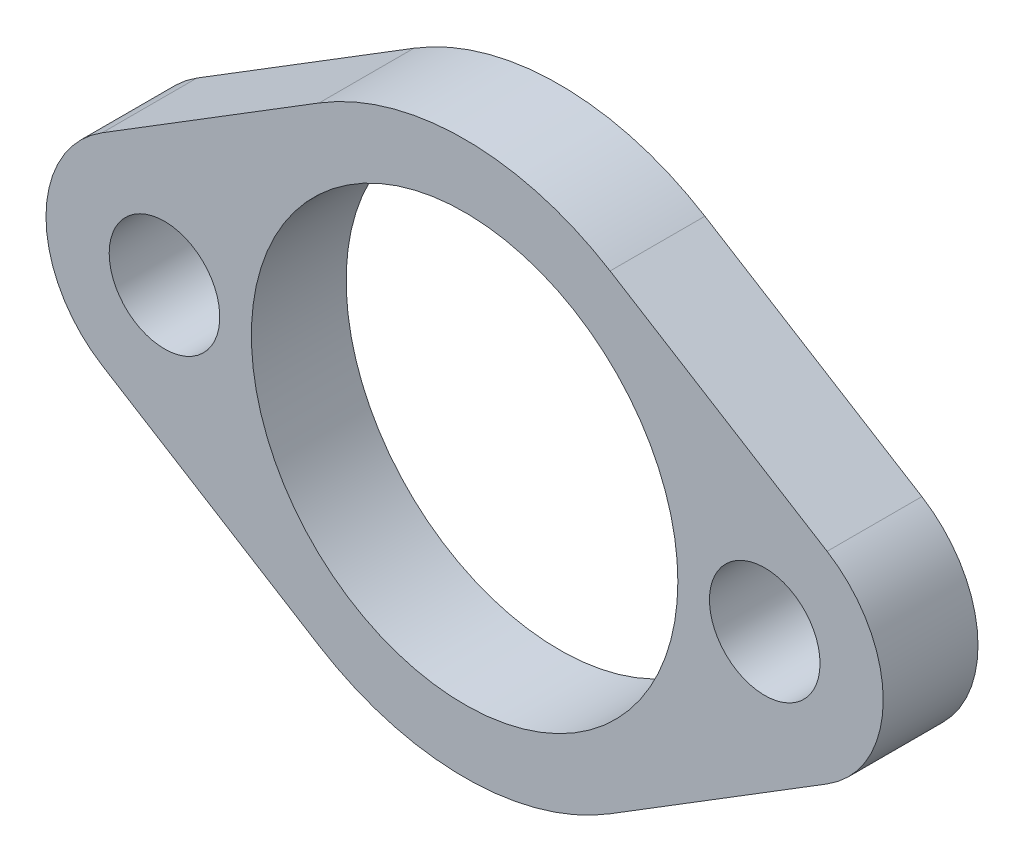
ISO-10303-21;
HEADER;
FILE_DESCRIPTION(('STEP AP214'),'2;1');
FILE_NAME('part.step','',(''),(''),'','','');
FILE_SCHEMA(('AUTOMOTIVE_DESIGN { 1 0 10303 214 1 1 1 1 }'));
ENDSEC;
DATA;
#1=APPLICATION_CONTEXT('core data for automotive mechanical design processes');
#2=APPLICATION_PROTOCOL_DEFINITION('international standard','automotive_design',2000,#1);
#3=PRODUCT_CONTEXT('',#1,'mechanical');
#4=PRODUCT('Part','Part','',(#3));
#5=PRODUCT_RELATED_PRODUCT_CATEGORY('part','',(#4));
#6=PRODUCT_DEFINITION_FORMATION('','',#4);
#7=PRODUCT_DEFINITION_CONTEXT('part definition',#1,'design');
#8=PRODUCT_DEFINITION('design','',#6,#7);
#9=PRODUCT_DEFINITION_SHAPE('','',#8);
#10=(LENGTH_UNIT() NAMED_UNIT(*) SI_UNIT(.MILLI.,.METRE.));
#11=(NAMED_UNIT(*) PLANE_ANGLE_UNIT() SI_UNIT($,.RADIAN.));
#12=(NAMED_UNIT(*) SI_UNIT($,.STERADIAN.) SOLID_ANGLE_UNIT());
#13=UNCERTAINTY_MEASURE_WITH_UNIT(LENGTH_MEASURE(1.E-05),#10,'distance_accuracy_value','');
#14=(GEOMETRIC_REPRESENTATION_CONTEXT(3) GLOBAL_UNCERTAINTY_ASSIGNED_CONTEXT((#13)) GLOBAL_UNIT_ASSIGNED_CONTEXT((#10,
#11,#12)) REPRESENTATION_CONTEXT('',''));
#15=CARTESIAN_POINT('',(0.,0.,0.));
#16=DIRECTION('',(0.,0.,1.));
#17=DIRECTION('',(1.,0.,0.));
#18=AXIS2_PLACEMENT_3D('',#15,#16,#17);
#19=CARTESIAN_POINT('',(0.,0.,3.));
#20=DIRECTION('',(0.,0.,1.));
#21=DIRECTION('',(1.,0.,0.));
#22=AXIS2_PLACEMENT_3D('',#19,#20,#21);
#23=PLANE('',#22);
#24=CARTESIAN_POINT('',(9.5,0.,3.));
#25=DIRECTION('',(0.,0.,1.));
#26=DIRECTION('',(1.,0.,0.));
#27=AXIS2_PLACEMENT_3D('',#24,#25,#26);
#28=CIRCLE('',#27,1.75);
#29=CARTESIAN_POINT('',(11.25,0.,3.));
#30=VERTEX_POINT('',#29);
#31=EDGE_CURVE('E217',#30,#30,#28,.T.);
#32=ORIENTED_EDGE('',*,*,#31,.F.);
#33=EDGE_LOOP('',(#32));
#34=FACE_BOUND('',#33,.T.);
#35=CARTESIAN_POINT('',(0.,0.,3.));
#36=DIRECTION('',(0.,0.,1.));
#37=DIRECTION('',(1.,0.,0.));
#38=AXIS2_PLACEMENT_3D('',#35,#36,#37);
#39=CIRCLE('',#38,8.75);
#40=CARTESIAN_POINT('',(4.60526315789474,7.44003032564635,3.));
#41=VERTEX_POINT('',#40);
#42=CARTESIAN_POINT('',(-4.60526315789473,7.44003032564635,3.));
#43=VERTEX_POINT('',#42);
#44=EDGE_CURVE('E168',#41,#43,#39,.T.);
#45=ORIENTED_EDGE('',*,*,#44,.T.);
#46=DIRECTION('',(-0.850289180073869,-0.526315789473684,0.));
#47=VECTOR('',#46,1.);
#48=CARTESIAN_POINT('',(-4.60526315789473,7.44003032564635,3.));
#49=LINE('',#48,#47);
#50=CARTESIAN_POINT('',(-11.4736842105263,3.18858442527702,3.));
#51=VERTEX_POINT('',#50);
#52=EDGE_CURVE('E104',#43,#51,#49,.T.);
#53=ORIENTED_EDGE('',*,*,#52,.T.);
#54=CARTESIAN_POINT('',(-9.5,0.,3.));
#55=DIRECTION('',(0.,0.,1.));
#56=DIRECTION('',(1.,0.,0.));
#57=AXIS2_PLACEMENT_3D('',#54,#55,#56);
#58=CIRCLE('',#57,3.75);
#59=CARTESIAN_POINT('',(-11.4736842105263,-3.18858442527701,3.));
#60=VERTEX_POINT('',#59);
#61=EDGE_CURVE('E189',#51,#60,#58,.T.);
#62=ORIENTED_EDGE('',*,*,#61,.T.);
#63=DIRECTION('',(0.850289180073869,-0.526315789473684,0.));
#64=VECTOR('',#63,1.);
#65=CARTESIAN_POINT('',(-4.60526315789473,-7.44003032564635,3.));
#66=LINE('',#65,#64);
#67=CARTESIAN_POINT('',(-4.60526315789473,-7.44003032564635,3.));
#68=VERTEX_POINT('',#67);
#69=EDGE_CURVE('E203',#60,#68,#66,.T.);
#70=ORIENTED_EDGE('',*,*,#69,.T.);
#71=CARTESIAN_POINT('',(0.,0.,3.));
#72=DIRECTION('',(0.,0.,1.));
#73=DIRECTION('',(-1.,0.,0.));
#74=AXIS2_PLACEMENT_3D('',#71,#72,#73);
#75=CIRCLE('',#74,8.75);
#76=CARTESIAN_POINT('',(4.60526315789474,-7.44003032564635,3.));
#77=VERTEX_POINT('',#76);
#78=EDGE_CURVE('E123',#68,#77,#75,.T.);
#79=ORIENTED_EDGE('',*,*,#78,.T.);
#80=DIRECTION('',(0.850289180073869,0.526315789473684,0.));
#81=VECTOR('',#80,1.);
#82=CARTESIAN_POINT('',(4.60526315789474,-7.44003032564635,3.));
#83=LINE('',#82,#81);
#84=CARTESIAN_POINT('',(11.4736842105263,-3.18858442527701,3.));
#85=VERTEX_POINT('',#84);
#86=EDGE_CURVE('E117',#77,#85,#83,.T.);
#87=ORIENTED_EDGE('',*,*,#86,.T.);
#88=CARTESIAN_POINT('',(9.5,0.,3.));
#89=DIRECTION('',(0.,0.,1.));
#90=DIRECTION('',(-1.,0.,0.));
#91=AXIS2_PLACEMENT_3D('',#88,#89,#90);
#92=CIRCLE('',#91,3.75);
#93=CARTESIAN_POINT('',(11.4736842105263,3.18858442527701,3.));
#94=VERTEX_POINT('',#93);
#95=EDGE_CURVE('E121',#85,#94,#92,.T.);
#96=ORIENTED_EDGE('',*,*,#95,.T.);
#97=DIRECTION('',(-0.850289180073869,0.526315789473684,0.));
#98=VECTOR('',#97,1.);
#99=CARTESIAN_POINT('',(4.60526315789474,7.44003032564635,3.));
#100=LINE('',#99,#98);
#101=EDGE_CURVE('E61',#94,#41,#100,.T.);
#102=ORIENTED_EDGE('',*,*,#101,.T.);
#103=EDGE_LOOP('',(#45,#53,#62,#70,#79,#87,#96,#102));
#104=FACE_BOUND('',#103,.T.);
#105=CARTESIAN_POINT('',(0.,0.,3.));
#106=DIRECTION('',(0.,0.,1.));
#107=DIRECTION('',(1.,0.,0.));
#108=AXIS2_PLACEMENT_3D('',#105,#106,#107);
#109=CIRCLE('',#108,6.75);
#110=CARTESIAN_POINT('',(6.75,0.,3.));
#111=VERTEX_POINT('',#110);
#112=EDGE_CURVE('E150',#111,#111,#109,.T.);
#113=ORIENTED_EDGE('',*,*,#112,.F.);
#114=EDGE_LOOP('',(#113));
#115=FACE_BOUND('',#114,.T.);
#116=CARTESIAN_POINT('',(-9.5,0.,3.));
#117=DIRECTION('',(0.,0.,1.));
#118=DIRECTION('',(-1.,0.,0.));
#119=AXIS2_PLACEMENT_3D('',#116,#117,#118);
#120=CIRCLE('',#119,1.75);
#121=CARTESIAN_POINT('',(-11.25,0.,3.));
#122=VERTEX_POINT('',#121);
#123=EDGE_CURVE('E225',#122,#122,#120,.T.);
#124=ORIENTED_EDGE('',*,*,#123,.F.);
#125=EDGE_LOOP('',(#124));
#126=FACE_BOUND('',#125,.T.);
#127=ADVANCED_FACE('F43',(#34,#104,#115,#126),#23,.T.);
#128=CARTESIAN_POINT('',(0.,0.,0.));
#129=DIRECTION('',(0.,0.,1.));
#130=DIRECTION('',(1.,0.,0.));
#131=AXIS2_PLACEMENT_3D('',#128,#129,#130);
#132=PLANE('',#131);
#133=CARTESIAN_POINT('',(0.,0.,0.));
#134=DIRECTION('',(0.,0.,1.));
#135=DIRECTION('',(1.,0.,0.));
#136=AXIS2_PLACEMENT_3D('',#133,#134,#135);
#137=CIRCLE('',#136,8.75);
#138=CARTESIAN_POINT('',(4.60526315789474,7.44003032564635,0.));
#139=VERTEX_POINT('',#138);
#140=CARTESIAN_POINT('',(-4.60526315789473,7.44003032564635,0.));
#141=VERTEX_POINT('',#140);
#142=EDGE_CURVE('E145',#139,#141,#137,.T.);
#143=ORIENTED_EDGE('',*,*,#142,.F.);
#144=DIRECTION('',(-0.850289180073869,0.526315789473684,0.));
#145=VECTOR('',#144,1.);
#146=CARTESIAN_POINT('',(4.60526315789474,7.44003032564635,0.));
#147=LINE('',#146,#145);
#148=CARTESIAN_POINT('',(11.4736842105263,3.18858442527701,0.));
#149=VERTEX_POINT('',#148);
#150=EDGE_CURVE('E96',#149,#139,#147,.T.);
#151=ORIENTED_EDGE('',*,*,#150,.F.);
#152=CARTESIAN_POINT('',(9.5,0.,0.));
#153=DIRECTION('',(0.,0.,1.));
#154=DIRECTION('',(-1.,0.,0.));
#155=AXIS2_PLACEMENT_3D('',#152,#153,#154);
#156=CIRCLE('',#155,3.75);
#157=CARTESIAN_POINT('',(11.4736842105263,-3.18858442527701,0.));
#158=VERTEX_POINT('',#157);
#159=EDGE_CURVE('E90',#158,#149,#156,.T.);
#160=ORIENTED_EDGE('',*,*,#159,.F.);
#161=DIRECTION('',(0.850289180073869,0.526315789473684,0.));
#162=VECTOR('',#161,1.);
#163=CARTESIAN_POINT('',(4.60526315789474,-7.44003032564635,0.));
#164=LINE('',#163,#162);
#165=CARTESIAN_POINT('',(4.60526315789474,-7.44003032564635,0.));
#166=VERTEX_POINT('',#165);
#167=EDGE_CURVE('E132',#166,#158,#164,.T.);
#168=ORIENTED_EDGE('',*,*,#167,.F.);
#169=CARTESIAN_POINT('',(0.,0.,0.));
#170=DIRECTION('',(0.,0.,1.));
#171=DIRECTION('',(-1.,0.,0.));
#172=AXIS2_PLACEMENT_3D('',#169,#170,#171);
#173=CIRCLE('',#172,8.75);
#174=CARTESIAN_POINT('',(-4.60526315789473,-7.44003032564635,0.));
#175=VERTEX_POINT('',#174);
#176=EDGE_CURVE('E159',#175,#166,#173,.T.);
#177=ORIENTED_EDGE('',*,*,#176,.F.);
#178=DIRECTION('',(0.850289180073869,-0.526315789473684,0.));
#179=VECTOR('',#178,1.);
#180=CARTESIAN_POINT('',(-4.60526315789473,-7.44003032564635,0.));
#181=LINE('',#180,#179);
#182=CARTESIAN_POINT('',(-11.4736842105263,-3.18858442527701,0.));
#183=VERTEX_POINT('',#182);
#184=EDGE_CURVE('E156',#183,#175,#181,.T.);
#185=ORIENTED_EDGE('',*,*,#184,.F.);
#186=CARTESIAN_POINT('',(-9.5,0.,0.));
#187=DIRECTION('',(0.,0.,1.));
#188=DIRECTION('',(1.,0.,0.));
#189=AXIS2_PLACEMENT_3D('',#186,#187,#188);
#190=CIRCLE('',#189,3.75);
#191=CARTESIAN_POINT('',(-11.4736842105263,3.18858442527702,0.));
#192=VERTEX_POINT('',#191);
#193=EDGE_CURVE('E153',#192,#183,#190,.T.);
#194=ORIENTED_EDGE('',*,*,#193,.F.);
#195=DIRECTION('',(-0.850289180073869,-0.526315789473684,0.));
#196=VECTOR('',#195,1.);
#197=CARTESIAN_POINT('',(-4.60526315789473,7.44003032564635,0.));
#198=LINE('',#197,#196);
#199=EDGE_CURVE('E149',#141,#192,#198,.T.);
#200=ORIENTED_EDGE('',*,*,#199,.F.);
#201=EDGE_LOOP('',(#143,#151,#160,#168,#177,#185,#194,#200));
#202=FACE_BOUND('',#201,.T.);
#203=CARTESIAN_POINT('',(0.,0.,0.));
#204=DIRECTION('',(0.,0.,1.));
#205=DIRECTION('',(1.,0.,0.));
#206=AXIS2_PLACEMENT_3D('',#203,#204,#205);
#207=CIRCLE('',#206,6.75);
#208=CARTESIAN_POINT('',(6.75,0.,0.));
#209=VERTEX_POINT('',#208);
#210=EDGE_CURVE('E213',#209,#209,#207,.T.);
#211=ORIENTED_EDGE('',*,*,#210,.T.);
#212=EDGE_LOOP('',(#211));
#213=FACE_BOUND('',#212,.T.);
#214=CARTESIAN_POINT('',(9.5,0.,0.));
#215=DIRECTION('',(0.,0.,1.));
#216=DIRECTION('',(1.,0.,0.));
#217=AXIS2_PLACEMENT_3D('',#214,#215,#216);
#218=CIRCLE('',#217,1.75);
#219=CARTESIAN_POINT('',(11.25,0.,0.));
#220=VERTEX_POINT('',#219);
#221=EDGE_CURVE('E221',#220,#220,#218,.T.);
#222=ORIENTED_EDGE('',*,*,#221,.T.);
#223=EDGE_LOOP('',(#222));
#224=FACE_BOUND('',#223,.T.);
#225=CARTESIAN_POINT('',(-9.5,0.,0.));
#226=DIRECTION('',(0.,0.,1.));
#227=DIRECTION('',(-1.,0.,0.));
#228=AXIS2_PLACEMENT_3D('',#225,#226,#227);
#229=CIRCLE('',#228,1.75);
#230=CARTESIAN_POINT('',(-11.25,0.,0.));
#231=VERTEX_POINT('',#230);
#232=EDGE_CURVE('E229',#231,#231,#229,.T.);
#233=ORIENTED_EDGE('',*,*,#232,.T.);
#234=EDGE_LOOP('',(#233));
#235=FACE_BOUND('',#234,.T.);
#236=ADVANCED_FACE('F193',(#202,#213,#224,#235),#132,.F.);
#237=CARTESIAN_POINT('',(0.,0.,3.));
#238=DIRECTION('',(0.,0.,-1.));
#239=DIRECTION('',(-1.,0.,0.));
#240=AXIS2_PLACEMENT_3D('',#237,#238,#239);
#241=CYLINDRICAL_SURFACE('',#240,8.75);
#242=ORIENTED_EDGE('',*,*,#142,.T.);
#243=DIRECTION('',(0.,0.,-1.));
#244=VECTOR('',#243,1.);
#245=CARTESIAN_POINT('',(-4.60526315789473,7.44003032564635,3.));
#246=LINE('',#245,#244);
#247=EDGE_CURVE('E11',#43,#141,#246,.T.);
#248=ORIENTED_EDGE('',*,*,#247,.F.);
#249=ORIENTED_EDGE('',*,*,#44,.F.);
#250=DIRECTION('',(0.,0.,-1.));
#251=VECTOR('',#250,1.);
#252=CARTESIAN_POINT('',(4.60526315789474,7.44003032564635,3.));
#253=LINE('',#252,#251);
#254=EDGE_CURVE('E141',#41,#139,#253,.T.);
#255=ORIENTED_EDGE('',*,*,#254,.T.);
#256=EDGE_LOOP('',(#242,#248,#249,#255));
#257=FACE_BOUND('',#256,.T.);
#258=ADVANCED_FACE('F45',(#257),#241,.T.);
#259=CARTESIAN_POINT('',(-4.60526315789473,7.44003032564635,3.));
#260=DIRECTION('',(0.526315789473684,-0.850289180073869,0.));
#261=DIRECTION('',(0.850289180073869,0.526315789473684,0.));
#262=AXIS2_PLACEMENT_3D('',#259,#260,#261);
#263=PLANE('',#262);
#264=ORIENTED_EDGE('',*,*,#199,.T.);
#265=DIRECTION('',(0.,0.,-1.));
#266=VECTOR('',#265,1.);
#267=CARTESIAN_POINT('',(-11.4736842105263,3.18858442527702,3.));
#268=LINE('',#267,#266);
#269=EDGE_CURVE('E53',#51,#192,#268,.T.);
#270=ORIENTED_EDGE('',*,*,#269,.F.);
#271=ORIENTED_EDGE('',*,*,#52,.F.);
#272=ORIENTED_EDGE('',*,*,#247,.T.);
#273=EDGE_LOOP('',(#264,#270,#271,#272));
#274=FACE_BOUND('',#273,.T.);
#275=ADVANCED_FACE('F264',(#274),#263,.F.);
#276=CARTESIAN_POINT('',(-9.5,0.,3.));
#277=DIRECTION('',(0.,0.,-1.));
#278=DIRECTION('',(-1.,0.,0.));
#279=AXIS2_PLACEMENT_3D('',#276,#277,#278);
#280=CYLINDRICAL_SURFACE('',#279,3.75);
#281=ORIENTED_EDGE('',*,*,#193,.T.);
#282=DIRECTION('',(0.,0.,-1.));
#283=VECTOR('',#282,1.);
#284=CARTESIAN_POINT('',(-11.4736842105263,-3.18858442527701,3.));
#285=LINE('',#284,#283);
#286=EDGE_CURVE('E179',#60,#183,#285,.T.);
#287=ORIENTED_EDGE('',*,*,#286,.F.);
#288=ORIENTED_EDGE('',*,*,#61,.F.);
#289=ORIENTED_EDGE('',*,*,#269,.T.);
#290=EDGE_LOOP('',(#281,#287,#288,#289));
#291=FACE_BOUND('',#290,.T.);
#292=ADVANCED_FACE('F187',(#291),#280,.T.);
#293=CARTESIAN_POINT('',(-4.60526315789473,-7.44003032564635,3.));
#294=DIRECTION('',(0.526315789473684,0.850289180073869,0.));
#295=DIRECTION('',(-0.850289180073869,0.526315789473684,0.));
#296=AXIS2_PLACEMENT_3D('',#293,#294,#295);
#297=PLANE('',#296);
#298=ORIENTED_EDGE('',*,*,#184,.T.);
#299=DIRECTION('',(0.,0.,-1.));
#300=VECTOR('',#299,1.);
#301=CARTESIAN_POINT('',(-4.60526315789473,-7.44003032564635,3.));
#302=LINE('',#301,#300);
#303=EDGE_CURVE('E175',#68,#175,#302,.T.);
#304=ORIENTED_EDGE('',*,*,#303,.F.);
#305=ORIENTED_EDGE('',*,*,#69,.F.);
#306=ORIENTED_EDGE('',*,*,#286,.T.);
#307=EDGE_LOOP('',(#298,#304,#305,#306));
#308=FACE_BOUND('',#307,.T.);
#309=ADVANCED_FACE('F198',(#308),#297,.F.);
#310=CARTESIAN_POINT('',(0.,0.,3.));
#311=DIRECTION('',(0.,0.,-1.));
#312=DIRECTION('',(-1.,0.,0.));
#313=AXIS2_PLACEMENT_3D('',#310,#311,#312);
#314=CYLINDRICAL_SURFACE('',#313,8.75);
#315=ORIENTED_EDGE('',*,*,#176,.T.);
#316=DIRECTION('',(0.,0.,-1.));
#317=VECTOR('',#316,1.);
#318=CARTESIAN_POINT('',(4.60526315789474,-7.44003032564635,3.));
#319=LINE('',#318,#317);
#320=EDGE_CURVE('E134',#77,#166,#319,.T.);
#321=ORIENTED_EDGE('',*,*,#320,.F.);
#322=ORIENTED_EDGE('',*,*,#78,.F.);
#323=ORIENTED_EDGE('',*,*,#303,.T.);
#324=EDGE_LOOP('',(#315,#321,#322,#323));
#325=FACE_BOUND('',#324,.T.);
#326=ADVANCED_FACE('F201',(#325),#314,.T.);
#327=CARTESIAN_POINT('',(4.60526315789474,-7.44003032564635,3.));
#328=DIRECTION('',(-0.526315789473684,0.850289180073869,0.));
#329=DIRECTION('',(-0.850289180073869,-0.526315789473684,0.));
#330=AXIS2_PLACEMENT_3D('',#327,#328,#329);
#331=PLANE('',#330);
#332=ORIENTED_EDGE('',*,*,#167,.T.);
#333=DIRECTION('',(0.,0.,-1.));
#334=VECTOR('',#333,1.);
#335=CARTESIAN_POINT('',(11.4736842105263,-3.18858442527701,3.));
#336=LINE('',#335,#334);
#337=EDGE_CURVE('E129',#85,#158,#336,.T.);
#338=ORIENTED_EDGE('',*,*,#337,.F.);
#339=ORIENTED_EDGE('',*,*,#86,.F.);
#340=ORIENTED_EDGE('',*,*,#320,.T.);
#341=EDGE_LOOP('',(#332,#338,#339,#340));
#342=FACE_BOUND('',#341,.T.);
#343=ADVANCED_FACE('F130',(#342),#331,.F.);
#344=CARTESIAN_POINT('',(9.5,0.,3.));
#345=DIRECTION('',(0.,0.,-1.));
#346=DIRECTION('',(-1.,0.,0.));
#347=AXIS2_PLACEMENT_3D('',#344,#345,#346);
#348=CYLINDRICAL_SURFACE('',#347,3.75);
#349=ORIENTED_EDGE('',*,*,#159,.T.);
#350=DIRECTION('',(0.,0.,-1.));
#351=VECTOR('',#350,1.);
#352=CARTESIAN_POINT('',(11.4736842105263,3.18858442527701,3.));
#353=LINE('',#352,#351);
#354=EDGE_CURVE('E135',#94,#149,#353,.T.);
#355=ORIENTED_EDGE('',*,*,#354,.F.);
#356=ORIENTED_EDGE('',*,*,#95,.F.);
#357=ORIENTED_EDGE('',*,*,#337,.T.);
#358=EDGE_LOOP('',(#349,#355,#356,#357));
#359=FACE_BOUND('',#358,.T.);
#360=ADVANCED_FACE('F137',(#359),#348,.T.);
#361=CARTESIAN_POINT('',(4.60526315789474,7.44003032564635,3.));
#362=DIRECTION('',(-0.526315789473684,-0.850289180073869,0.));
#363=DIRECTION('',(0.850289180073869,-0.526315789473684,0.));
#364=AXIS2_PLACEMENT_3D('',#361,#362,#363);
#365=PLANE('',#364);
#366=ORIENTED_EDGE('',*,*,#150,.T.);
#367=ORIENTED_EDGE('',*,*,#254,.F.);
#368=ORIENTED_EDGE('',*,*,#101,.F.);
#369=ORIENTED_EDGE('',*,*,#354,.T.);
#370=EDGE_LOOP('',(#366,#367,#368,#369));
#371=FACE_BOUND('',#370,.T.);
#372=ADVANCED_FACE('F252',(#371),#365,.F.);
#373=CARTESIAN_POINT('',(0.,0.,3.));
#374=DIRECTION('',(0.,0.,-1.));
#375=DIRECTION('',(-1.,0.,0.));
#376=AXIS2_PLACEMENT_3D('',#373,#374,#375);
#377=CYLINDRICAL_SURFACE('',#376,6.75);
#378=ORIENTED_EDGE('',*,*,#112,.T.);
#379=EDGE_LOOP('',(#378));
#380=FACE_BOUND('',#379,.T.);
#381=ORIENTED_EDGE('',*,*,#210,.F.);
#382=EDGE_LOOP('',(#381));
#383=FACE_BOUND('',#382,.T.);
#384=ADVANCED_FACE('F249',(#380,#383),#377,.F.);
#385=CARTESIAN_POINT('',(9.5,0.,3.));
#386=DIRECTION('',(0.,0.,-1.));
#387=DIRECTION('',(-1.,0.,0.));
#388=AXIS2_PLACEMENT_3D('',#385,#386,#387);
#389=CYLINDRICAL_SURFACE('',#388,1.75);
#390=ORIENTED_EDGE('',*,*,#31,.T.);
#391=EDGE_LOOP('',(#390));
#392=FACE_BOUND('',#391,.T.);
#393=ORIENTED_EDGE('',*,*,#221,.F.);
#394=EDGE_LOOP('',(#393));
#395=FACE_BOUND('',#394,.T.);
#396=ADVANCED_FACE('F340',(#392,#395),#389,.F.);
#397=CARTESIAN_POINT('',(-9.5,0.,3.));
#398=DIRECTION('',(0.,0.,-1.));
#399=DIRECTION('',(-1.,0.,0.));
#400=AXIS2_PLACEMENT_3D('',#397,#398,#399);
#401=CYLINDRICAL_SURFACE('',#400,1.75);
#402=ORIENTED_EDGE('',*,*,#123,.T.);
#403=EDGE_LOOP('',(#402));
#404=FACE_BOUND('',#403,.T.);
#405=ORIENTED_EDGE('',*,*,#232,.F.);
#406=EDGE_LOOP('',(#405));
#407=FACE_BOUND('',#406,.T.);
#408=ADVANCED_FACE('F237',(#404,#407),#401,.F.);
#409=CLOSED_SHELL('',(#127,#236,#258,#275,#292,#309,#326,#343,#360,#372,#384,#396,#408));
#410=MANIFOLD_SOLID_BREP('B2',#409);
#411=ADVANCED_BREP_SHAPE_REPRESENTATION('',(#18,#410),#14);
#412=SHAPE_DEFINITION_REPRESENTATION(#9,#411);
ENDSEC;
END-ISO-10303-21;
